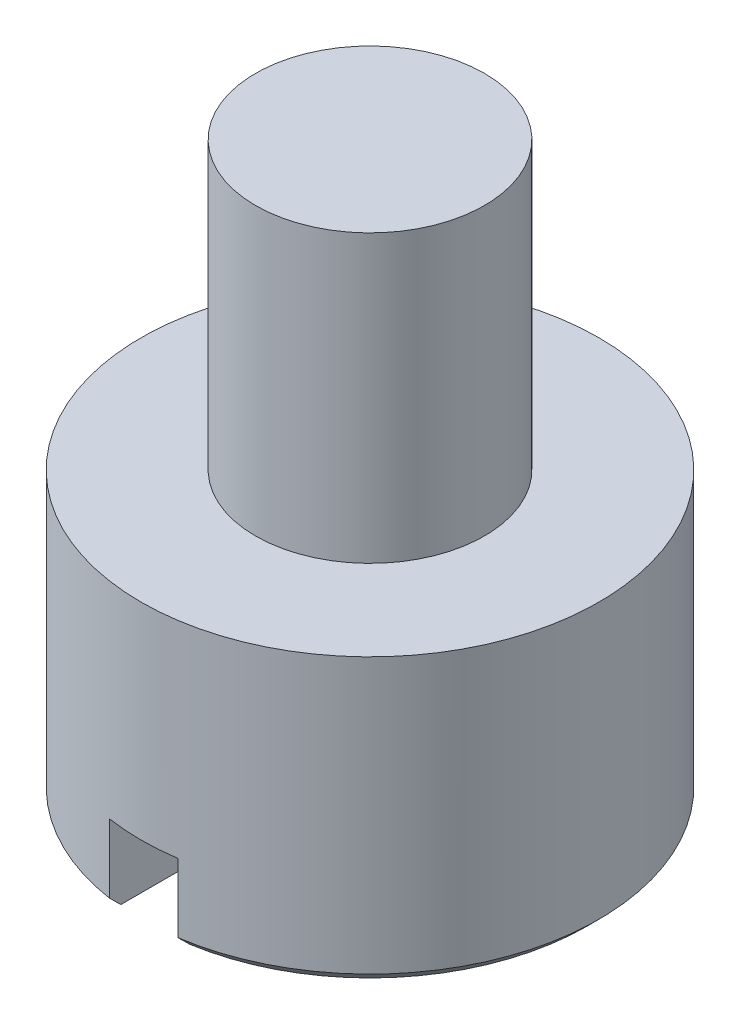
ISO-10303-21;
HEADER;
FILE_DESCRIPTION(('STEP AP214'),'2;1');
FILE_NAME('part.step','',(''),(''),'','','');
FILE_SCHEMA(('AUTOMOTIVE_DESIGN { 1 0 10303 214 1 1 1 1 }'));
ENDSEC;
DATA;
#1=APPLICATION_CONTEXT('core data for automotive mechanical design processes');
#2=APPLICATION_PROTOCOL_DEFINITION('international standard','automotive_design',2000,#1);
#3=PRODUCT_CONTEXT('',#1,'mechanical');
#4=PRODUCT('Part','Part','',(#3));
#5=PRODUCT_RELATED_PRODUCT_CATEGORY('part','',(#4));
#6=PRODUCT_DEFINITION_FORMATION('','',#4);
#7=PRODUCT_DEFINITION_CONTEXT('part definition',#1,'design');
#8=PRODUCT_DEFINITION('design','',#6,#7);
#9=PRODUCT_DEFINITION_SHAPE('','',#8);
#10=(LENGTH_UNIT() NAMED_UNIT(*) SI_UNIT(.MILLI.,.METRE.));
#11=(NAMED_UNIT(*) PLANE_ANGLE_UNIT() SI_UNIT($,.RADIAN.));
#12=(NAMED_UNIT(*) SI_UNIT($,.STERADIAN.) SOLID_ANGLE_UNIT());
#13=UNCERTAINTY_MEASURE_WITH_UNIT(LENGTH_MEASURE(1.E-05),#10,'distance_accuracy_value','');
#14=(GEOMETRIC_REPRESENTATION_CONTEXT(3) GLOBAL_UNCERTAINTY_ASSIGNED_CONTEXT((#13)) GLOBAL_UNIT_ASSIGNED_CONTEXT((#10,
#11,#12)) REPRESENTATION_CONTEXT('',''));
#15=CARTESIAN_POINT('',(0.,0.,0.));
#16=DIRECTION('',(0.,0.,1.));
#17=DIRECTION('',(1.,0.,0.));
#18=AXIS2_PLACEMENT_3D('',#15,#16,#17);
#19=CARTESIAN_POINT('',(0.,0.,0.));
#20=DIRECTION('',(0.,1.,0.));
#21=DIRECTION('',(0.,0.,1.));
#22=AXIS2_PLACEMENT_3D('',#19,#20,#21);
#23=PLANE('',#22);
#24=CARTESIAN_POINT('',(0.,0.,0.));
#25=DIRECTION('',(0.,1.,0.));
#26=DIRECTION('',(0.,0.,1.));
#27=AXIS2_PLACEMENT_3D('',#24,#25,#26);
#28=CIRCLE('',#27,0.950000000000001);
#29=CARTESIAN_POINT('',(-0.15,0.,0.938083151964687));
#30=VERTEX_POINT('',#29);
#31=CARTESIAN_POINT('',(-0.15,0.,-0.938083151964687));
#32=VERTEX_POINT('',#31);
#33=EDGE_CURVE('E117',#30,#32,#28,.F.);
#34=ORIENTED_EDGE('',*,*,#33,.T.);
#35=DIRECTION('',(0.,0.,1.));
#36=VECTOR('',#35,1.);
#37=CARTESIAN_POINT('',(-0.15,0.,-1.));
#38=LINE('',#37,#36);
#39=EDGE_CURVE('E114',#32,#30,#38,.T.);
#40=ORIENTED_EDGE('',*,*,#39,.T.);
#41=EDGE_LOOP('',(#34,#40));
#42=FACE_BOUND('',#41,.T.);
#43=ADVANCED_FACE('F41',(#42),#23,.F.);
#44=CARTESIAN_POINT('',(0.,0.049999999999999,0.));
#45=DIRECTION('',(0.,1.,0.));
#46=DIRECTION('',(0.,0.,1.));
#47=AXIS2_PLACEMENT_3D('',#44,#45,#46);
#48=CONICAL_SURFACE('',#47,1.,0.785398163397448);
#49=CARTESIAN_POINT('',(-0.15,1.25057494142455,2.19545668889771));
#50=CARTESIAN_POINT('',(-0.15,1.17486482760702,2.11956867376752));
#51=CARTESIAN_POINT('',(-0.15,1.09916252895078,2.04367285905298));
#52=CARTESIAN_POINT('',(-0.15,0.947781880495718,1.8918538110874));
#53=CARTESIAN_POINT('',(-0.15,0.87210353129833,1.81593057723667));
#54=CARTESIAN_POINT('',(-0.15,0.720741730945291,1.66400735697265));
#55=CARTESIAN_POINT('',(-0.15,0.645058299157705,1.588007351256));
#56=CARTESIAN_POINT('',(-0.15,0.493748137567004,1.43595438129768));
#57=CARTESIAN_POINT('',(-0.15,0.418121406511406,1.35990141830193));
#58=CARTESIAN_POINT('',(-0.15,0.266680527910447,1.20743203433834));
#59=CARTESIAN_POINT('',(-0.15,0.190866698290238,1.13101529705919));
#60=CARTESIAN_POINT('',(-0.15,0.039395569815009,0.978017024071283));
#61=CARTESIAN_POINT('',(-0.15,-0.0362617182570067,0.901435477705685));
#62=CARTESIAN_POINT('',(-0.15,-0.18724681068219,0.747995830450191));
#63=CARTESIAN_POINT('',(-0.15,-0.262574715241123,0.671137828829968));
#64=CARTESIAN_POINT('',(-0.15,-0.374928082629421,0.55523974533162));
#65=CARTESIAN_POINT('',(-0.15,-0.412270784521886,0.516507318773429));
#66=CARTESIAN_POINT('',(-0.15,-0.486556263261614,0.438661399571845));
#67=CARTESIAN_POINT('',(-0.15,-0.523499062885484,0.39954792887464));
#68=CARTESIAN_POINT('',(-0.15,-0.569915917947431,0.34925632779944));
#69=CARTESIAN_POINT('',(-0.15,-0.579810759066341,0.338467881222693));
#70=CARTESIAN_POINT('',(-0.15,-0.599506636996827,0.316805661548227));
#71=CARTESIAN_POINT('',(-0.15,-0.609307671006004,0.305931885918933));
#72=CARTESIAN_POINT('',(-0.15,-0.638550421919318,0.273133305542226));
#73=CARTESIAN_POINT('',(-0.15,-0.65781644388563,0.251047724310014));
#74=CARTESIAN_POINT('',(-0.15,-0.691761268258487,0.210440067788724));
#75=CARTESIAN_POINT('',(-0.15,-0.706605941249344,0.19205607079643));
#76=CARTESIAN_POINT('',(-0.15,-0.735126093214577,0.154367829209324));
#77=CARTESIAN_POINT('',(-0.15,-0.748802385693291,0.135064239725647));
#78=CARTESIAN_POINT('',(-0.15,-0.767172444553892,0.104820759606316));
#79=CARTESIAN_POINT('',(-0.15,-0.772930917355897,0.0945423272730661));
#80=CARTESIAN_POINT('',(-0.15,-0.783262621998878,0.0733948128056592));
#81=CARTESIAN_POINT('',(-0.15,-0.787837532820857,0.06252659412396));
#82=CARTESIAN_POINT('',(-0.15,-0.794276941797131,0.0426259954524375));
#83=CARTESIAN_POINT('',(-0.15,-0.796517367873674,0.0337203138487117));
#84=CARTESIAN_POINT('',(-0.15,-0.799444554213064,0.015667510205098));
#85=CARTESIAN_POINT('',(-0.15,-0.800135836730777,0.00652116999116203));
#86=CARTESIAN_POINT('',(-0.15,-0.799818408139961,-0.0117610175356856));
#87=CARTESIAN_POINT('',(-0.15,-0.798805761402432,-0.0208967916506735));
#88=CARTESIAN_POINT('',(-0.15,-0.7952960028604,-0.0388839346117649));
#89=CARTESIAN_POINT('',(-0.15,-0.792795188920167,-0.0477345359480316));
#90=CARTESIAN_POINT('',(-0.15,-0.78627275070882,-0.066277907184388));
#91=CARTESIAN_POINT('',(-0.15,-0.782084613228342,-0.0759097505364513));
#92=CARTESIAN_POINT('',(-0.15,-0.772783771320633,-0.0947238714638712));
#93=CARTESIAN_POINT('',(-0.15,-0.767669160514112,-0.103905171515738));
#94=CARTESIAN_POINT('',(-0.15,-0.756796885019835,-0.121983637597861));
#95=CARTESIAN_POINT('',(-0.15,-0.751033918308257,-0.130877560567997));
#96=CARTESIAN_POINT('',(-0.15,-0.739108580053702,-0.1483771134012));
#97=CARTESIAN_POINT('',(-0.15,-0.732946607226283,-0.156983018412976));
#98=CARTESIAN_POINT('',(-0.15,-0.712767938458251,-0.184228616010587));
#99=CARTESIAN_POINT('',(-0.15,-0.69822527994581,-0.202475828833117));
#100=CARTESIAN_POINT('',(-0.15,-0.66848417851822,-0.238430960753038));
#101=CARTESIAN_POINT('',(-0.15,-0.653285356946195,-0.256138558119068));
#102=CARTESIAN_POINT('',(-0.15,-0.607094752163646,-0.308833348971522));
#103=CARTESIAN_POINT('',(-0.15,-0.575553436862906,-0.343337159346094));
#104=CARTESIAN_POINT('',(-0.15,-0.512050674748372,-0.411637801329114));
#105=CARTESIAN_POINT('',(-0.15,-0.480091953332755,-0.445437222109503));
#106=CARTESIAN_POINT('',(-0.15,-0.41589477877519,-0.512708195595531));
#107=CARTESIAN_POINT('',(-0.15,-0.383656625032062,-0.54618003298582));
#108=CARTESIAN_POINT('',(-0.15,-0.285475483860456,-0.647602201768358));
#109=CARTESIAN_POINT('',(-0.15,-0.219266127047882,-0.715293574073159));
#110=CARTESIAN_POINT('',(-0.15,-0.0865611420291629,-0.850396911311292));
#111=CARTESIAN_POINT('',(-0.15,-0.0200655081645575,-0.917808870669665));
#112=CARTESIAN_POINT('',(-0.15,0.179702867887359,-1.11989234651246));
#113=CARTESIAN_POINT('',(-0.15,0.313194382847234,-1.25434748089469));
#114=CARTESIAN_POINT('',(-0.15,0.580644196808417,-1.5233375125438));
#115=CARTESIAN_POINT('',(-0.15,0.714602892710978,-1.65787201418775));
#116=CARTESIAN_POINT('',(-0.15,0.982561692001623,-1.9267608905754));
#117=CARTESIAN_POINT('',(-0.15,1.11656173796512,-2.06111532253305));
#118=CARTESIAN_POINT('',(-0.15,1.25057494142455,-2.19545668889771));
#119=B_SPLINE_CURVE_WITH_KNOTS('',3,(#49,#50,#51,#52,#53,#54,#55,#56,#57,#58,#59,#60,#61,#62,
#63,#64,#65,#66,#67,#68,#69,#70,#71,#72,#73,#74,#75,#76,#77,#78,#79,#80,#81,#82,#83,#84,#85,#86,
#87,#88,#89,#90,#91,#92,#93,#94,#95,#96,#97,#98,#99,#100,#101,#102,#103,#104,#105,#106,#107,
#108,#109,#110,#111,#112,#113,#114,#115,#116,#117,#118),.UNSPECIFIED.,.F.,.F.,(4,2,2,2,2,2,2,2,
2,2,2,2,2,2,2,2,2,2,2,2,2,2,2,2,2,2,2,2,2,2,2,2,2,2,4),(0.,0.321588417468614,0.643184355197931,
0.964954186711429,1.28671668778452,1.60964871659107,1.93260229487446,2.25544962738521,
2.41685580699182,2.57825274475185,2.62216885766033,2.6660862784516,2.75398866515695,
2.82486990316422,2.89570137972455,2.93100470760388,2.96625767671461,2.99370072404128,
3.02106355477533,3.04848967325314,3.07598430701183,3.10741670069593,3.13891452225512,
3.17069176015115,3.20243771987044,3.2723995844516,3.34240237670843,3.4826210997067,
3.62217025721211,3.76158487366265,4.04564654578253,4.32971385859028,4.89811722722493,
5.4676786714876,6.03694498439831),.UNSPECIFIED.);
#120=CARTESIAN_POINT('',(-0.15,0.0500000000000467,0.988685996664329));
#121=VERTEX_POINT('',#120);
#122=EDGE_CURVE('E175',#121,#30,#119,.T.);
#123=ORIENTED_EDGE('',*,*,#122,.F.);
#124=CARTESIAN_POINT('',(0.,0.049999999999999,0.));
#125=DIRECTION('',(0.,1.,0.));
#126=DIRECTION('',(0.,0.,1.));
#127=AXIS2_PLACEMENT_3D('',#124,#125,#126);
#128=CIRCLE('',#127,1.);
#129=CARTESIAN_POINT('',(-0.15,0.0499999999999991,-0.988685996664259));
#130=VERTEX_POINT('',#129);
#131=EDGE_CURVE('E123',#130,#121,#128,.T.);
#132=ORIENTED_EDGE('',*,*,#131,.F.);
#133=EDGE_CURVE('E105',#32,#130,#119,.T.);
#134=ORIENTED_EDGE('',*,*,#133,.F.);
#135=ORIENTED_EDGE('',*,*,#33,.F.);
#136=EDGE_LOOP('',(#123,#132,#134,#135));
#137=FACE_BOUND('',#136,.T.);
#138=ADVANCED_FACE('F160',(#137),#48,.T.);
#139=CARTESIAN_POINT('',(0.,1.25,0.));
#140=DIRECTION('',(0.,-1.,0.));
#141=DIRECTION('',(0.,0.,-1.));
#142=AXIS2_PLACEMENT_3D('',#139,#140,#141);
#143=CYLINDRICAL_SURFACE('',#142,1.);
#144=CARTESIAN_POINT('',(0.,0.35,0.));
#145=DIRECTION('',(0.,1.,0.));
#146=DIRECTION('',(0.,0.,1.));
#147=AXIS2_PLACEMENT_3D('',#144,#145,#146);
#148=CIRCLE('',#147,1.);
#149=CARTESIAN_POINT('',(-0.15,0.35,0.988685996664259));
#150=VERTEX_POINT('',#149);
#151=CARTESIAN_POINT('',(0.15,0.35,0.988685996664259));
#152=VERTEX_POINT('',#151);
#153=EDGE_CURVE('E46',#150,#152,#148,.T.);
#154=ORIENTED_EDGE('',*,*,#153,.T.);
#155=DIRECTION('',(0.,-1.,0.));
#156=VECTOR('',#155,1.);
#157=CARTESIAN_POINT('',(0.15,1.25,0.988685996664259));
#158=LINE('',#157,#156);
#159=CARTESIAN_POINT('',(0.15,0.0499999999999991,0.988685996664259));
#160=VERTEX_POINT('',#159);
#161=EDGE_CURVE('E183',#152,#160,#158,.T.);
#162=ORIENTED_EDGE('',*,*,#161,.T.);
#163=CARTESIAN_POINT('',(0.15,0.0500000000000467,-0.988685996664329));
#164=VERTEX_POINT('',#163);
#165=EDGE_CURVE('E118',#160,#164,#128,.T.);
#166=ORIENTED_EDGE('',*,*,#165,.T.);
#167=DIRECTION('',(0.,-1.,0.));
#168=VECTOR('',#167,1.);
#169=CARTESIAN_POINT('',(0.15,1.25,-0.988685996664259));
#170=LINE('',#169,#168);
#171=CARTESIAN_POINT('',(0.15,0.35,-0.988685996664259));
#172=VERTEX_POINT('',#171);
#173=EDGE_CURVE('E99',#164,#172,#170,.F.);
#174=ORIENTED_EDGE('',*,*,#173,.T.);
#175=CARTESIAN_POINT('',(-0.15,0.35,-0.988685996664259));
#176=VERTEX_POINT('',#175);
#177=EDGE_CURVE('E11',#172,#176,#148,.T.);
#178=ORIENTED_EDGE('',*,*,#177,.T.);
#179=DIRECTION('',(0.,-1.,0.));
#180=VECTOR('',#179,1.);
#181=CARTESIAN_POINT('',(-0.15,1.25,-0.988685996664259));
#182=LINE('',#181,#180);
#183=EDGE_CURVE('E199',#176,#130,#182,.T.);
#184=ORIENTED_EDGE('',*,*,#183,.T.);
#185=ORIENTED_EDGE('',*,*,#131,.T.);
#186=DIRECTION('',(0.,-1.,0.));
#187=VECTOR('',#186,1.);
#188=CARTESIAN_POINT('',(-0.15,1.25,0.988685996664259));
#189=LINE('',#188,#187);
#190=EDGE_CURVE('E66',#121,#150,#189,.F.);
#191=ORIENTED_EDGE('',*,*,#190,.T.);
#192=EDGE_LOOP('',(#154,#162,#166,#174,#178,#184,#185,#191));
#193=FACE_BOUND('',#192,.T.);
#194=CARTESIAN_POINT('',(0.,1.25,0.));
#195=DIRECTION('',(0.,1.,0.));
#196=DIRECTION('',(0.,0.,1.));
#197=AXIS2_PLACEMENT_3D('',#194,#195,#196);
#198=CIRCLE('',#197,1.);
#199=CARTESIAN_POINT('',(0.,1.25,1.));
#200=VERTEX_POINT('',#199);
#201=EDGE_CURVE('E208',#200,#200,#198,.T.);
#202=ORIENTED_EDGE('',*,*,#201,.F.);
#203=EDGE_LOOP('',(#202));
#204=FACE_BOUND('',#203,.T.);
#205=ADVANCED_FACE('F156',(#193,#204),#143,.T.);
#206=CARTESIAN_POINT('',(0.,1.25,0.));
#207=DIRECTION('',(0.,1.,0.));
#208=DIRECTION('',(0.,0.,1.));
#209=AXIS2_PLACEMENT_3D('',#206,#207,#208);
#210=PLANE('',#209);
#211=CARTESIAN_POINT('',(0.,1.25,0.));
#212=DIRECTION('',(0.,1.,0.));
#213=DIRECTION('',(0.,0.,1.));
#214=AXIS2_PLACEMENT_3D('',#211,#212,#213);
#215=CIRCLE('',#214,0.5);
#216=CARTESIAN_POINT('',(0.,1.25,0.5));
#217=VERTEX_POINT('',#216);
#218=EDGE_CURVE('E209',#217,#217,#215,.T.);
#219=ORIENTED_EDGE('',*,*,#218,.F.);
#220=EDGE_LOOP('',(#219));
#221=FACE_BOUND('',#220,.T.);
#222=ORIENTED_EDGE('',*,*,#201,.T.);
#223=EDGE_LOOP('',(#222));
#224=FACE_BOUND('',#223,.T.);
#225=ADVANCED_FACE('F153',(#221,#224),#210,.T.);
#226=CARTESIAN_POINT('',(0.15,0.,-0.938083151964687));
#227=VERTEX_POINT('',#226);
#228=CARTESIAN_POINT('',(0.15,0.,0.938083151964687));
#229=VERTEX_POINT('',#228);
#230=EDGE_CURVE('E111',#227,#229,#28,.F.);
#231=ORIENTED_EDGE('',*,*,#230,.T.);
#232=DIRECTION('',(0.,0.,1.));
#233=VECTOR('',#232,1.);
#234=CARTESIAN_POINT('',(0.15,0.,-1.));
#235=LINE('',#234,#233);
#236=EDGE_CURVE('E58',#227,#229,#235,.T.);
#237=ORIENTED_EDGE('',*,*,#236,.F.);
#238=EDGE_LOOP('',(#231,#237));
#239=FACE_BOUND('',#238,.T.);
#240=ADVANCED_FACE('F110',(#239),#23,.F.);
#241=CARTESIAN_POINT('',(0.,2.5,0.));
#242=DIRECTION('',(0.,-1.,0.));
#243=DIRECTION('',(0.,0.,-1.));
#244=AXIS2_PLACEMENT_3D('',#241,#242,#243);
#245=CYLINDRICAL_SURFACE('',#244,0.5);
#246=CARTESIAN_POINT('',(0.,2.5,0.));
#247=DIRECTION('',(0.,1.,0.));
#248=DIRECTION('',(0.,0.,1.));
#249=AXIS2_PLACEMENT_3D('',#246,#247,#248);
#250=CIRCLE('',#249,0.5);
#251=CARTESIAN_POINT('',(0.,2.5,0.5));
#252=VERTEX_POINT('',#251);
#253=EDGE_CURVE('E204',#252,#252,#250,.T.);
#254=ORIENTED_EDGE('',*,*,#253,.F.);
#255=EDGE_LOOP('',(#254));
#256=FACE_BOUND('',#255,.T.);
#257=ORIENTED_EDGE('',*,*,#218,.T.);
#258=EDGE_LOOP('',(#257));
#259=FACE_BOUND('',#258,.T.);
#260=ADVANCED_FACE('F148',(#256,#259),#245,.T.);
#261=CARTESIAN_POINT('',(0.,2.5,0.));
#262=DIRECTION('',(0.,1.,0.));
#263=DIRECTION('',(0.,0.,1.));
#264=AXIS2_PLACEMENT_3D('',#261,#262,#263);
#265=PLANE('',#264);
#266=ORIENTED_EDGE('',*,*,#253,.T.);
#267=EDGE_LOOP('',(#266));
#268=FACE_BOUND('',#267,.T.);
#269=ADVANCED_FACE('F145',(#268),#265,.T.);
#270=CARTESIAN_POINT('',(0.15,1.25057494142455,-2.19545668889771));
#271=CARTESIAN_POINT('',(0.15,1.17486482760702,-2.11956867376752));
#272=CARTESIAN_POINT('',(0.15,1.09916252895078,-2.04367285905298));
#273=CARTESIAN_POINT('',(0.15,0.947781880495718,-1.8918538110874));
#274=CARTESIAN_POINT('',(0.15,0.872103531298329,-1.81593057723667));
#275=CARTESIAN_POINT('',(0.15,0.72074173094529,-1.66400735697265));
#276=CARTESIAN_POINT('',(0.15,0.645058299157704,-1.588007351256));
#277=CARTESIAN_POINT('',(0.15,0.493748137567003,-1.43595438129768));
#278=CARTESIAN_POINT('',(0.15,0.418121406511404,-1.35990141830193));
#279=CARTESIAN_POINT('',(0.15,0.266680527910446,-1.20743203433834));
#280=CARTESIAN_POINT('',(0.15,0.190866698290237,-1.13101529705919));
#281=CARTESIAN_POINT('',(0.15,0.0393955698150083,-0.978017024071283));
#282=CARTESIAN_POINT('',(0.15,-0.0362617182570072,-0.901435477705685));
#283=CARTESIAN_POINT('',(0.15,-0.18724681068219,-0.747995830450191));
#284=CARTESIAN_POINT('',(0.15,-0.262574715241124,-0.671137828829968));
#285=CARTESIAN_POINT('',(0.15,-0.374928082629421,-0.55523974533162));
#286=CARTESIAN_POINT('',(0.15,-0.412270784521886,-0.516507318773429));
#287=CARTESIAN_POINT('',(0.15,-0.486556263261614,-0.438661399571845));
#288=CARTESIAN_POINT('',(0.15,-0.523499062885483,-0.399547928874641));
#289=CARTESIAN_POINT('',(0.15,-0.56991591794743,-0.349256327799441));
#290=CARTESIAN_POINT('',(0.15,-0.57981075906634,-0.338467881222694));
#291=CARTESIAN_POINT('',(0.15,-0.599506636996826,-0.316805661548227));
#292=CARTESIAN_POINT('',(0.15,-0.609307671006003,-0.305931885918934));
#293=CARTESIAN_POINT('',(0.15,-0.638550421919318,-0.273133305542226));
#294=CARTESIAN_POINT('',(0.15,-0.65781644388563,-0.251047724310014));
#295=CARTESIAN_POINT('',(0.15,-0.691761268258487,-0.210440067788725));
#296=CARTESIAN_POINT('',(0.15,-0.706605941249343,-0.192056070796431));
#297=CARTESIAN_POINT('',(0.15,-0.735126093214577,-0.154367829209325));
#298=CARTESIAN_POINT('',(0.15,-0.748802385693291,-0.135064239725647));
#299=CARTESIAN_POINT('',(0.15,-0.767172444553892,-0.104820759606317));
#300=CARTESIAN_POINT('',(0.15,-0.772930917355896,-0.0945423272730666));
#301=CARTESIAN_POINT('',(0.15,-0.783262621998877,-0.0733948128056596));
#302=CARTESIAN_POINT('',(0.15,-0.787837532820857,-0.0625265941239603));
#303=CARTESIAN_POINT('',(0.15,-0.794276941797131,-0.0426259954524378));
#304=CARTESIAN_POINT('',(0.15,-0.796517367873674,-0.0337203138487121));
#305=CARTESIAN_POINT('',(0.15,-0.799444554213064,-0.0156675102050984));
#306=CARTESIAN_POINT('',(0.15,-0.800135836730777,-0.00652116999116239));
#307=CARTESIAN_POINT('',(0.15,-0.799818408139961,0.0117610175356852));
#308=CARTESIAN_POINT('',(0.15,-0.798805761402433,0.0208967916506731));
#309=CARTESIAN_POINT('',(0.15,-0.7952960028604,0.0388839346117646));
#310=CARTESIAN_POINT('',(0.15,-0.792795188920167,0.0477345359480313));
#311=CARTESIAN_POINT('',(0.15,-0.78627275070882,0.0662779071843876));
#312=CARTESIAN_POINT('',(0.15,-0.782084613228342,0.0759097505364508));
#313=CARTESIAN_POINT('',(0.15,-0.772783771320633,0.0947238714638705));
#314=CARTESIAN_POINT('',(0.15,-0.767669160514113,0.103905171515737));
#315=CARTESIAN_POINT('',(0.15,-0.756796885019835,0.121983637597861));
#316=CARTESIAN_POINT('',(0.15,-0.751033918308257,0.130877560567996));
#317=CARTESIAN_POINT('',(0.15,-0.739108580053703,0.148377113401199));
#318=CARTESIAN_POINT('',(0.15,-0.732946607226283,0.156983018412975));
#319=CARTESIAN_POINT('',(0.15,-0.712767938458252,0.184228616010586));
#320=CARTESIAN_POINT('',(0.15,-0.698225279945811,0.202475828833116));
#321=CARTESIAN_POINT('',(0.15,-0.668484178518221,0.238430960753037));
#322=CARTESIAN_POINT('',(0.15,-0.653285356946195,0.256138558119067));
#323=CARTESIAN_POINT('',(0.15,-0.607094752163647,0.30883334897152));
#324=CARTESIAN_POINT('',(0.15,-0.575553436862907,0.343337159346093));
#325=CARTESIAN_POINT('',(0.15,-0.512050674748374,0.411637801329113));
#326=CARTESIAN_POINT('',(0.15,-0.480091953332756,0.445437222109501));
#327=CARTESIAN_POINT('',(0.15,-0.415894778775192,0.512708195595528));
#328=CARTESIAN_POINT('',(0.15,-0.383656625032065,0.546180032985818));
#329=CARTESIAN_POINT('',(0.15,-0.285475483860459,0.647602201768356));
#330=CARTESIAN_POINT('',(0.15,-0.219266127047885,0.715293574073157));
#331=CARTESIAN_POINT('',(0.15,-0.0865611420291649,0.850396911311289));
#332=CARTESIAN_POINT('',(0.15,-0.0200655081645593,0.917808870669664));
#333=CARTESIAN_POINT('',(0.15,0.179702867887358,1.11989234651246));
#334=CARTESIAN_POINT('',(0.15,0.313194382847233,1.25434748089469));
#335=CARTESIAN_POINT('',(0.15,0.580644196808417,1.5233375125438));
#336=CARTESIAN_POINT('',(0.15,0.714602892710978,1.65787201418775));
#337=CARTESIAN_POINT('',(0.15,0.982561692001623,1.9267608905754));
#338=CARTESIAN_POINT('',(0.15,1.11656173796512,2.06111532253305));
#339=CARTESIAN_POINT('',(0.15,1.25057494142455,2.19545668889771));
#340=B_SPLINE_CURVE_WITH_KNOTS('',3,(#270,#271,#272,#273,#274,#275,#276,#277,#278,#279,#280,
#281,#282,#283,#284,#285,#286,#287,#288,#289,#290,#291,#292,#293,#294,#295,#296,#297,#298,#299,
#300,#301,#302,#303,#304,#305,#306,#307,#308,#309,#310,#311,#312,#313,#314,#315,#316,#317,#318,
#319,#320,#321,#322,#323,#324,#325,#326,#327,#328,#329,#330,#331,#332,#333,#334,#335,#336,#337,
#338,#339),.UNSPECIFIED.,.F.,.F.,(4,2,2,2,2,2,2,2,2,2,2,2,2,2,2,2,2,2,2,2,2,2,2,2,2,2,2,2,2,2,2,
2,2,2,4),(0.,0.321588417468614,0.643184355197932,0.96495418671143,1.28671668778452,
1.60964871659107,1.93260229487446,2.25544962738521,2.41685580699182,2.57825274475185,
2.62216885766033,2.6660862784516,2.75398866515695,2.82486990316422,2.89570137972455,
2.93100470760388,2.9662576767146,2.99370072404128,3.02106355477533,3.04848967325313,
3.07598430701182,3.10741670069593,3.13891452225512,3.17069176015114,3.20243771987044,
3.2723995844516,3.34240237670843,3.48262109970669,3.62217025721211,3.76158487366264,
4.04564654578253,4.32971385859028,4.89811722722493,5.4676786714876,6.03694498439831),.UNSPECIFIED.);
#341=EDGE_CURVE('E95',#164,#227,#340,.T.);
#342=ORIENTED_EDGE('',*,*,#341,.F.);
#343=ORIENTED_EDGE('',*,*,#165,.F.);
#344=EDGE_CURVE('E106',#229,#160,#340,.T.);
#345=ORIENTED_EDGE('',*,*,#344,.F.);
#346=ORIENTED_EDGE('',*,*,#230,.F.);
#347=EDGE_LOOP('',(#342,#343,#345,#346));
#348=FACE_BOUND('',#347,.T.);
#349=ADVANCED_FACE('F43',(#348),#48,.T.);
#350=CARTESIAN_POINT('',(-0.15,0.35,-1.));
#351=DIRECTION('',(0.,1.,0.));
#352=DIRECTION('',(0.,0.,1.));
#353=AXIS2_PLACEMENT_3D('',#350,#351,#352);
#354=PLANE('',#353);
#355=DIRECTION('',(0.,0.,1.));
#356=VECTOR('',#355,1.);
#357=CARTESIAN_POINT('',(0.15,0.35,-1.));
#358=LINE('',#357,#356);
#359=EDGE_CURVE('E113',#172,#152,#358,.T.);
#360=ORIENTED_EDGE('',*,*,#359,.T.);
#361=ORIENTED_EDGE('',*,*,#153,.F.);
#362=DIRECTION('',(0.,0.,1.));
#363=VECTOR('',#362,1.);
#364=CARTESIAN_POINT('',(-0.15,0.35,-1.));
#365=LINE('',#364,#363);
#366=EDGE_CURVE('E188',#176,#150,#365,.T.);
#367=ORIENTED_EDGE('',*,*,#366,.F.);
#368=ORIENTED_EDGE('',*,*,#177,.F.);
#369=EDGE_LOOP('',(#360,#361,#367,#368));
#370=FACE_BOUND('',#369,.T.);
#371=ADVANCED_FACE('F141',(#370),#354,.F.);
#372=CARTESIAN_POINT('',(-0.15,0.35,-1.));
#373=DIRECTION('',(-1.,0.,0.));
#374=DIRECTION('',(0.,-1.,0.));
#375=AXIS2_PLACEMENT_3D('',#372,#373,#374);
#376=PLANE('',#375);
#377=ORIENTED_EDGE('',*,*,#122,.T.);
#378=ORIENTED_EDGE('',*,*,#39,.F.);
#379=ORIENTED_EDGE('',*,*,#133,.T.);
#380=ORIENTED_EDGE('',*,*,#183,.F.);
#381=ORIENTED_EDGE('',*,*,#366,.T.);
#382=ORIENTED_EDGE('',*,*,#190,.F.);
#383=EDGE_LOOP('',(#377,#378,#379,#380,#381,#382));
#384=FACE_BOUND('',#383,.T.);
#385=ADVANCED_FACE('F140',(#384),#376,.F.);
#386=CARTESIAN_POINT('',(0.15,0.35,-1.));
#387=DIRECTION('',(1.,0.,0.));
#388=DIRECTION('',(0.,1.,0.));
#389=AXIS2_PLACEMENT_3D('',#386,#387,#388);
#390=PLANE('',#389);
#391=ORIENTED_EDGE('',*,*,#341,.T.);
#392=ORIENTED_EDGE('',*,*,#236,.T.);
#393=ORIENTED_EDGE('',*,*,#344,.T.);
#394=ORIENTED_EDGE('',*,*,#161,.F.);
#395=ORIENTED_EDGE('',*,*,#359,.F.);
#396=ORIENTED_EDGE('',*,*,#173,.F.);
#397=EDGE_LOOP('',(#391,#392,#393,#394,#395,#396));
#398=FACE_BOUND('',#397,.T.);
#399=ADVANCED_FACE('F96',(#398),#390,.F.);
#400=CLOSED_SHELL('',(#43,#138,#205,#225,#240,#260,#269,#349,#371,#385,#399));
#401=MANIFOLD_SOLID_BREP('B2',#400);
#402=ADVANCED_BREP_SHAPE_REPRESENTATION('',(#18,#401),#14);
#403=SHAPE_DEFINITION_REPRESENTATION(#9,#402);
ENDSEC;
END-ISO-10303-21;
